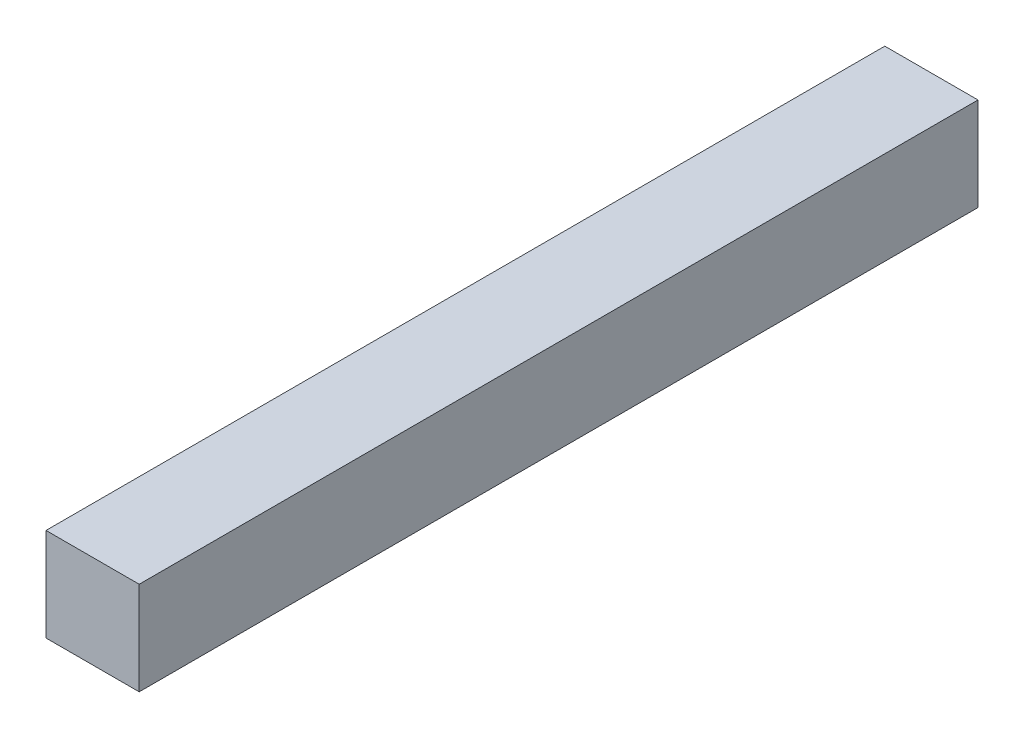
ISO-10303-21;
HEADER;
FILE_DESCRIPTION(('STEP AP214'),'2;1');
FILE_NAME('part.step','',(''),(''),'','','');
FILE_SCHEMA(('AUTOMOTIVE_DESIGN { 1 0 10303 214 1 1 1 1 }'));
ENDSEC;
DATA;
#1=APPLICATION_CONTEXT('core data for automotive mechanical design processes');
#2=APPLICATION_PROTOCOL_DEFINITION('international standard','automotive_design',2000,#1);
#3=PRODUCT_CONTEXT('',#1,'mechanical');
#4=PRODUCT('Part','Part','',(#3));
#5=PRODUCT_RELATED_PRODUCT_CATEGORY('part','',(#4));
#6=PRODUCT_DEFINITION_FORMATION('','',#4);
#7=PRODUCT_DEFINITION_CONTEXT('part definition',#1,'design');
#8=PRODUCT_DEFINITION('design','',#6,#7);
#9=PRODUCT_DEFINITION_SHAPE('','',#8);
#10=(LENGTH_UNIT() NAMED_UNIT(*) SI_UNIT(.MILLI.,.METRE.));
#11=(NAMED_UNIT(*) PLANE_ANGLE_UNIT() SI_UNIT($,.RADIAN.));
#12=(NAMED_UNIT(*) SI_UNIT($,.STERADIAN.) SOLID_ANGLE_UNIT());
#13=UNCERTAINTY_MEASURE_WITH_UNIT(LENGTH_MEASURE(1.E-05),#10,'distance_accuracy_value','');
#14=(GEOMETRIC_REPRESENTATION_CONTEXT(3) GLOBAL_UNCERTAINTY_ASSIGNED_CONTEXT((#13)) GLOBAL_UNIT_ASSIGNED_CONTEXT((#10,
#11,#12)) REPRESENTATION_CONTEXT('',''));
#15=CARTESIAN_POINT('',(0.,0.,0.));
#16=DIRECTION('',(0.,0.,1.));
#17=DIRECTION('',(1.,0.,0.));
#18=AXIS2_PLACEMENT_3D('',#15,#16,#17);
#19=CARTESIAN_POINT('',(10.,10.,180.));
#20=DIRECTION('',(-1.,0.,0.));
#21=DIRECTION('',(0.,-1.,0.));
#22=AXIS2_PLACEMENT_3D('',#19,#20,#21);
#23=PLANE('',#22);
#24=DIRECTION('',(0.,1.,0.));
#25=VECTOR('',#24,1.);
#26=CARTESIAN_POINT('',(10.,10.,0.));
#27=LINE('',#26,#25);
#28=CARTESIAN_POINT('',(10.,-10.,0.));
#29=VERTEX_POINT('',#28);
#30=CARTESIAN_POINT('',(10.,10.,0.));
#31=VERTEX_POINT('',#30);
#32=EDGE_CURVE('E97',#29,#31,#27,.T.);
#33=ORIENTED_EDGE('',*,*,#32,.T.);
#34=DIRECTION('',(0.,0.,-1.));
#35=VECTOR('',#34,1.);
#36=CARTESIAN_POINT('',(10.,10.,180.));
#37=LINE('',#36,#35);
#38=CARTESIAN_POINT('',(10.,10.,180.));
#39=VERTEX_POINT('',#38);
#40=EDGE_CURVE('E11',#39,#31,#37,.T.);
#41=ORIENTED_EDGE('',*,*,#40,.F.);
#42=DIRECTION('',(0.,1.,0.));
#43=VECTOR('',#42,1.);
#44=CARTESIAN_POINT('',(10.,10.,180.));
#45=LINE('',#44,#43);
#46=CARTESIAN_POINT('',(10.,-10.,180.));
#47=VERTEX_POINT('',#46);
#48=EDGE_CURVE('E85',#47,#39,#45,.T.);
#49=ORIENTED_EDGE('',*,*,#48,.F.);
#50=DIRECTION('',(0.,0.,-1.));
#51=VECTOR('',#50,1.);
#52=CARTESIAN_POINT('',(10.,-10.,180.));
#53=LINE('',#52,#51);
#54=EDGE_CURVE('E93',#47,#29,#53,.T.);
#55=ORIENTED_EDGE('',*,*,#54,.T.);
#56=EDGE_LOOP('',(#33,#41,#49,#55));
#57=FACE_BOUND('',#56,.T.);
#58=ADVANCED_FACE('F34',(#57),#23,.F.);
#59=CARTESIAN_POINT('',(-10.,10.,180.));
#60=DIRECTION('',(0.,-1.,0.));
#61=DIRECTION('',(0.,0.,-1.));
#62=AXIS2_PLACEMENT_3D('',#59,#60,#61);
#63=PLANE('',#62);
#64=DIRECTION('',(-1.,0.,0.));
#65=VECTOR('',#64,1.);
#66=CARTESIAN_POINT('',(-10.,10.,0.));
#67=LINE('',#66,#65);
#68=CARTESIAN_POINT('',(-10.,10.,0.));
#69=VERTEX_POINT('',#68);
#70=EDGE_CURVE('E89',#31,#69,#67,.T.);
#71=ORIENTED_EDGE('',*,*,#70,.T.);
#72=DIRECTION('',(0.,0.,-1.));
#73=VECTOR('',#72,1.);
#74=CARTESIAN_POINT('',(-10.,10.,180.));
#75=LINE('',#74,#73);
#76=CARTESIAN_POINT('',(-10.,10.,180.));
#77=VERTEX_POINT('',#76);
#78=EDGE_CURVE('E42',#77,#69,#75,.T.);
#79=ORIENTED_EDGE('',*,*,#78,.F.);
#80=DIRECTION('',(-1.,0.,0.));
#81=VECTOR('',#80,1.);
#82=CARTESIAN_POINT('',(-10.,10.,180.));
#83=LINE('',#82,#81);
#84=EDGE_CURVE('E80',#39,#77,#83,.T.);
#85=ORIENTED_EDGE('',*,*,#84,.F.);
#86=ORIENTED_EDGE('',*,*,#40,.T.);
#87=EDGE_LOOP('',(#71,#79,#85,#86));
#88=FACE_BOUND('',#87,.T.);
#89=ADVANCED_FACE('F88',(#88),#63,.F.);
#90=CARTESIAN_POINT('',(-10.,10.,180.));
#91=DIRECTION('',(1.,0.,0.));
#92=DIRECTION('',(0.,1.,0.));
#93=AXIS2_PLACEMENT_3D('',#90,#91,#92);
#94=PLANE('',#93);
#95=DIRECTION('',(0.,-1.,0.));
#96=VECTOR('',#95,1.);
#97=CARTESIAN_POINT('',(-10.,10.,0.));
#98=LINE('',#97,#96);
#99=CARTESIAN_POINT('',(-10.,-10.,0.));
#100=VERTEX_POINT('',#99);
#101=EDGE_CURVE('E67',#69,#100,#98,.T.);
#102=ORIENTED_EDGE('',*,*,#101,.T.);
#103=DIRECTION('',(0.,0.,-1.));
#104=VECTOR('',#103,1.);
#105=CARTESIAN_POINT('',(-10.,-10.,180.));
#106=LINE('',#105,#104);
#107=CARTESIAN_POINT('',(-10.,-10.,180.));
#108=VERTEX_POINT('',#107);
#109=EDGE_CURVE('E90',#108,#100,#106,.T.);
#110=ORIENTED_EDGE('',*,*,#109,.F.);
#111=DIRECTION('',(0.,-1.,0.));
#112=VECTOR('',#111,1.);
#113=CARTESIAN_POINT('',(-10.,10.,180.));
#114=LINE('',#113,#112);
#115=EDGE_CURVE('E83',#77,#108,#114,.T.);
#116=ORIENTED_EDGE('',*,*,#115,.F.);
#117=ORIENTED_EDGE('',*,*,#78,.T.);
#118=EDGE_LOOP('',(#102,#110,#116,#117));
#119=FACE_BOUND('',#118,.T.);
#120=ADVANCED_FACE('F91',(#119),#94,.F.);
#121=CARTESIAN_POINT('',(-10.,-10.,180.));
#122=DIRECTION('',(0.,1.,0.));
#123=DIRECTION('',(0.,0.,1.));
#124=AXIS2_PLACEMENT_3D('',#121,#122,#123);
#125=PLANE('',#124);
#126=DIRECTION('',(1.,0.,0.));
#127=VECTOR('',#126,1.);
#128=CARTESIAN_POINT('',(-10.,-10.,0.));
#129=LINE('',#128,#127);
#130=EDGE_CURVE('E73',#100,#29,#129,.T.);
#131=ORIENTED_EDGE('',*,*,#130,.T.);
#132=ORIENTED_EDGE('',*,*,#54,.F.);
#133=DIRECTION('',(1.,0.,0.));
#134=VECTOR('',#133,1.);
#135=CARTESIAN_POINT('',(-10.,-10.,180.));
#136=LINE('',#135,#134);
#137=EDGE_CURVE('E50',#108,#47,#136,.T.);
#138=ORIENTED_EDGE('',*,*,#137,.F.);
#139=ORIENTED_EDGE('',*,*,#109,.T.);
#140=EDGE_LOOP('',(#131,#132,#138,#139));
#141=FACE_BOUND('',#140,.T.);
#142=ADVANCED_FACE('F104',(#141),#125,.F.);
#143=CARTESIAN_POINT('',(0.,0.,180.));
#144=DIRECTION('',(0.,0.,1.));
#145=DIRECTION('',(1.,0.,0.));
#146=AXIS2_PLACEMENT_3D('',#143,#144,#145);
#147=PLANE('',#146);
#148=ORIENTED_EDGE('',*,*,#48,.T.);
#149=ORIENTED_EDGE('',*,*,#84,.T.);
#150=ORIENTED_EDGE('',*,*,#115,.T.);
#151=ORIENTED_EDGE('',*,*,#137,.T.);
#152=EDGE_LOOP('',(#148,#149,#150,#151));
#153=FACE_BOUND('',#152,.T.);
#154=ADVANCED_FACE('F81',(#153),#147,.T.);
#155=CARTESIAN_POINT('',(0.,0.,0.));
#156=DIRECTION('',(0.,0.,1.));
#157=DIRECTION('',(1.,0.,0.));
#158=AXIS2_PLACEMENT_3D('',#155,#156,#157);
#159=PLANE('',#158);
#160=ORIENTED_EDGE('',*,*,#32,.F.);
#161=ORIENTED_EDGE('',*,*,#130,.F.);
#162=ORIENTED_EDGE('',*,*,#101,.F.);
#163=ORIENTED_EDGE('',*,*,#70,.F.);
#164=EDGE_LOOP('',(#160,#161,#162,#163));
#165=FACE_BOUND('',#164,.T.);
#166=ADVANCED_FACE('F107',(#165),#159,.F.);
#167=CLOSED_SHELL('',(#58,#89,#120,#142,#154,#166));
#168=MANIFOLD_SOLID_BREP('B2',#167);
#169=ADVANCED_BREP_SHAPE_REPRESENTATION('',(#18,#168),#14);
#170=SHAPE_DEFINITION_REPRESENTATION(#9,#169);
ENDSEC;
END-ISO-10303-21;
